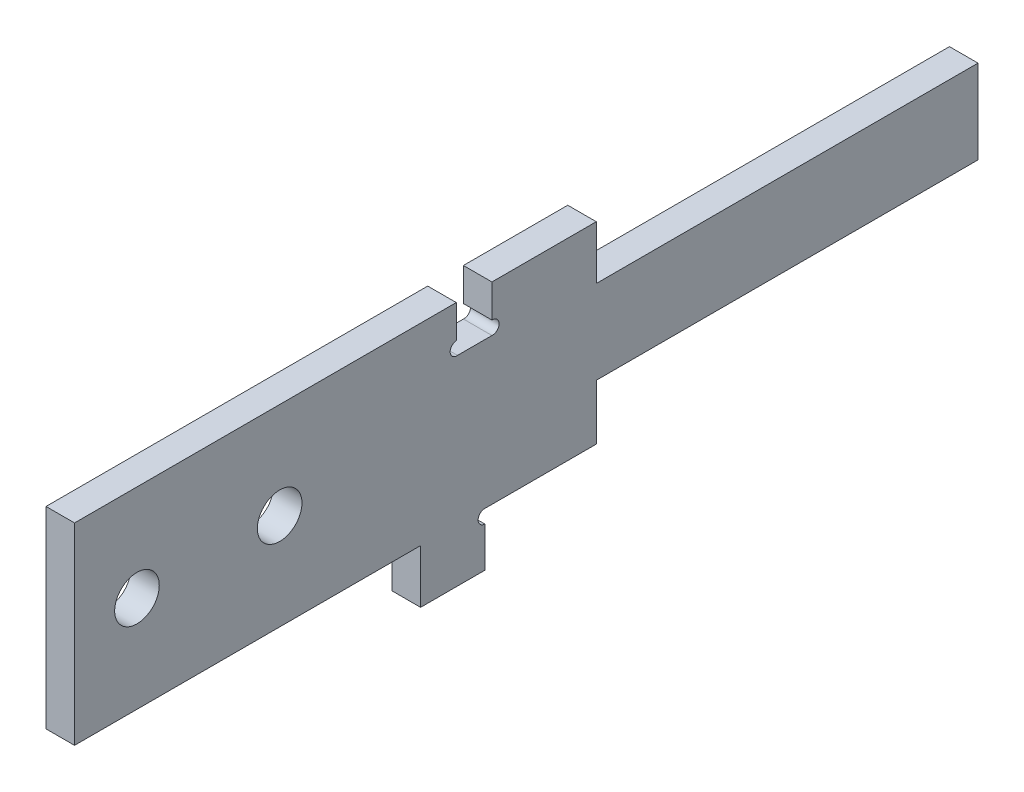
ISO-10303-21;
HEADER;
FILE_DESCRIPTION(('STEP AP214'),'2;1');
FILE_NAME('part.step','',(''),(''),'','','');
FILE_SCHEMA(('AUTOMOTIVE_DESIGN { 1 0 10303 214 1 1 1 1 }'));
ENDSEC;
DATA;
#1=APPLICATION_CONTEXT('core data for automotive mechanical design processes');
#2=APPLICATION_PROTOCOL_DEFINITION('international standard','automotive_design',2000,#1);
#3=PRODUCT_CONTEXT('',#1,'mechanical');
#4=PRODUCT('Part','Part','',(#3));
#5=PRODUCT_RELATED_PRODUCT_CATEGORY('part','',(#4));
#6=PRODUCT_DEFINITION_FORMATION('','',#4);
#7=PRODUCT_DEFINITION_CONTEXT('part definition',#1,'design');
#8=PRODUCT_DEFINITION('design','',#6,#7);
#9=PRODUCT_DEFINITION_SHAPE('','',#8);
#10=(LENGTH_UNIT() NAMED_UNIT(*) SI_UNIT(.MILLI.,.METRE.));
#11=(NAMED_UNIT(*) PLANE_ANGLE_UNIT() SI_UNIT($,.RADIAN.));
#12=(NAMED_UNIT(*) SI_UNIT($,.STERADIAN.) SOLID_ANGLE_UNIT());
#13=UNCERTAINTY_MEASURE_WITH_UNIT(LENGTH_MEASURE(1.E-05),#10,'distance_accuracy_value','');
#14=(GEOMETRIC_REPRESENTATION_CONTEXT(3) GLOBAL_UNCERTAINTY_ASSIGNED_CONTEXT((#13)) GLOBAL_UNIT_ASSIGNED_CONTEXT((#10,
#11,#12)) REPRESENTATION_CONTEXT('',''));
#15=CARTESIAN_POINT('',(0.,0.,0.));
#16=DIRECTION('',(0.,0.,1.));
#17=DIRECTION('',(1.,0.,0.));
#18=AXIS2_PLACEMENT_3D('',#15,#16,#17);
#19=CARTESIAN_POINT('',(-23.0168766341811,4.58768718801996,60.));
#20=DIRECTION('',(0.,1.,0.));
#21=DIRECTION('',(0.,0.,1.));
#22=AXIS2_PLACEMENT_3D('',#19,#20,#21);
#23=PLANE('',#22);
#24=DIRECTION('',(1.,0.,0.));
#25=VECTOR('',#24,1.);
#26=CARTESIAN_POINT('',(-23.0168766341811,4.58768718801996,37.));
#27=LINE('',#26,#25);
#28=CARTESIAN_POINT('',(-23.0168766341811,4.58768718801996,37.));
#29=VERTEX_POINT('',#28);
#30=CARTESIAN_POINT('',(-21.4168766341811,4.58768718801996,37.));
#31=VERTEX_POINT('',#30);
#32=EDGE_CURVE('E173',#29,#31,#27,.T.);
#33=ORIENTED_EDGE('',*,*,#32,.F.);
#34=DIRECTION('',(0.,0.,-1.));
#35=VECTOR('',#34,1.);
#36=CARTESIAN_POINT('',(-23.0168766341811,4.58768718801996,60.));
#37=LINE('',#36,#35);
#38=CARTESIAN_POINT('',(-23.0168766341811,4.58768718801996,30.75));
#39=VERTEX_POINT('',#38);
#40=EDGE_CURVE('E200',#29,#39,#37,.T.);
#41=ORIENTED_EDGE('',*,*,#40,.T.);
#42=DIRECTION('',(1.,0.,0.));
#43=VECTOR('',#42,1.);
#44=CARTESIAN_POINT('',(-21.4168766341811,4.58768718801996,30.75));
#45=LINE('',#44,#43);
#46=CARTESIAN_POINT('',(-21.4168766341811,4.58768718801996,30.75));
#47=VERTEX_POINT('',#46);
#48=EDGE_CURVE('E195',#39,#47,#45,.T.);
#49=ORIENTED_EDGE('',*,*,#48,.T.);
#50=DIRECTION('',(0.,0.,-1.));
#51=VECTOR('',#50,1.);
#52=CARTESIAN_POINT('',(-21.4168766341811,4.58768718801996,60.));
#53=LINE('',#52,#51);
#54=EDGE_CURVE('E188',#31,#47,#53,.T.);
#55=ORIENTED_EDGE('',*,*,#54,.F.);
#56=EDGE_LOOP('',(#33,#41,#49,#55));
#57=FACE_BOUND('',#56,.T.);
#58=ADVANCED_FACE('F34',(#57),#23,.F.);
#59=CARTESIAN_POINT('',(-23.0168766341811,15.38768718802,60.));
#60=DIRECTION('',(1.,0.,0.));
#61=DIRECTION('',(0.,0.,-1.));
#62=AXIS2_PLACEMENT_3D('',#59,#60,#61);
#63=PLANE('',#62);
#64=ORIENTED_EDGE('',*,*,#40,.F.);
#65=CARTESIAN_POINT('',(-23.0168766341811,4.21268718801996,37.));
#66=DIRECTION('',(-1.,0.,0.));
#67=DIRECTION('',(0.,0.,1.));
#68=AXIS2_PLACEMENT_3D('',#65,#66,#67);
#69=CIRCLE('',#68,0.374999999999999);
#70=CARTESIAN_POINT('',(-23.0168766341811,3.83768718801996,37.));
#71=VERTEX_POINT('',#70);
#72=EDGE_CURVE('E176',#71,#29,#69,.T.);
#73=ORIENTED_EDGE('',*,*,#72,.F.);
#74=DIRECTION('',(0.,1.,0.));
#75=VECTOR('',#74,1.);
#76=CARTESIAN_POINT('',(-23.0168766341811,-0.675054511777042,37.));
#77=LINE('',#76,#75);
#78=CARTESIAN_POINT('',(-23.0168766341811,1.58768718801991,37.));
#79=VERTEX_POINT('',#78);
#80=EDGE_CURVE('E181',#79,#71,#77,.T.);
#81=ORIENTED_EDGE('',*,*,#80,.F.);
#82=DIRECTION('',(0.,0.,-1.));
#83=VECTOR('',#82,1.);
#84=CARTESIAN_POINT('',(-23.0168766341811,1.5876871880199,40.6));
#85=LINE('',#84,#83);
#86=CARTESIAN_POINT('',(-23.0168766341811,1.5876871880199,40.6));
#87=VERTEX_POINT('',#86);
#88=EDGE_CURVE('E303',#87,#79,#85,.T.);
#89=ORIENTED_EDGE('',*,*,#88,.F.);
#90=DIRECTION('',(0.,1.,0.));
#91=VECTOR('',#90,1.);
#92=CARTESIAN_POINT('',(-23.0168766341811,1.5876871880199,40.6));
#93=LINE('',#92,#91);
#94=CARTESIAN_POINT('',(-23.0168766341811,4.58768718801996,40.6));
#95=VERTEX_POINT('',#94);
#96=EDGE_CURVE('E315',#87,#95,#93,.T.);
#97=ORIENTED_EDGE('',*,*,#96,.T.);
#98=CARTESIAN_POINT('',(-23.0168766341811,4.58768718801996,60.));
#99=VERTEX_POINT('',#98);
#100=EDGE_CURVE('E206',#99,#95,#37,.T.);
#101=ORIENTED_EDGE('',*,*,#100,.F.);
#102=DIRECTION('',(0.,-1.,0.));
#103=VECTOR('',#102,1.);
#104=CARTESIAN_POINT('',(-23.0168766341811,15.38768718802,60.));
#105=LINE('',#104,#103);
#106=CARTESIAN_POINT('',(-23.0168766341811,15.38768718802,60.));
#107=VERTEX_POINT('',#106);
#108=EDGE_CURVE('E268',#107,#99,#105,.T.);
#109=ORIENTED_EDGE('',*,*,#108,.F.);
#110=DIRECTION('',(0.,0.,-1.));
#111=VECTOR('',#110,1.);
#112=CARTESIAN_POINT('',(-23.0168766341811,15.38768718802,60.));
#113=LINE('',#112,#111);
#114=CARTESIAN_POINT('',(-23.0168766341811,15.38768718802,38.6));
#115=VERTEX_POINT('',#114);
#116=EDGE_CURVE('E277',#107,#115,#113,.T.);
#117=ORIENTED_EDGE('',*,*,#116,.T.);
#118=DIRECTION('',(0.,1.,0.));
#119=VECTOR('',#118,1.);
#120=CARTESIAN_POINT('',(-23.0168766341811,12.78768718802,38.6));
#121=LINE('',#120,#119);
#122=CARTESIAN_POINT('',(-23.0168766341811,13.53768718802,38.6));
#123=VERTEX_POINT('',#122);
#124=EDGE_CURVE('E351',#123,#115,#121,.T.);
#125=ORIENTED_EDGE('',*,*,#124,.F.);
#126=CARTESIAN_POINT('',(-23.0168766341811,13.16268718802,38.5658288618558));
#127=DIRECTION('',(-1.,0.,0.));
#128=DIRECTION('',(0.,0.,1.));
#129=AXIS2_PLACEMENT_3D('',#126,#127,#128);
#130=CIRCLE('',#129,0.376553670387203);
#131=CARTESIAN_POINT('',(-23.0168766341811,12.78768718802,38.6));
#132=VERTEX_POINT('',#131);
#133=EDGE_CURVE('E341',#132,#123,#130,.T.);
#134=ORIENTED_EDGE('',*,*,#133,.F.);
#135=CARTESIAN_POINT('',(-23.0168766341811,13.16268718802,38.5658288618558));
#136=DIRECTION('',(-1.,0.,0.));
#137=DIRECTION('',(0.,-0.995873973594242,-0.0907470590025637));
#138=AXIS2_PLACEMENT_3D('',#135,#136,#137);
#139=CIRCLE('',#138,0.376553670387203);
#140=CARTESIAN_POINT('',(-23.0168766341811,12.78768718802,38.5316577237115));
#141=VERTEX_POINT('',#140);
#142=EDGE_CURVE('E332',#141,#132,#139,.T.);
#143=ORIENTED_EDGE('',*,*,#142,.F.);
#144=DIRECTION('',(0.,0.,1.));
#145=VECTOR('',#144,1.);
#146=CARTESIAN_POINT('',(-23.0168766341811,12.78768718802,38.6));
#147=LINE('',#146,#145);
#148=CARTESIAN_POINT('',(-23.0168766341811,12.78768718802,36.6));
#149=VERTEX_POINT('',#148);
#150=EDGE_CURVE('E39',#149,#141,#147,.T.);
#151=ORIENTED_EDGE('',*,*,#150,.F.);
#152=CARTESIAN_POINT('',(-23.0168766341811,13.16268718802,36.5734535048503));
#153=DIRECTION('',(-1.,0.,0.));
#154=DIRECTION('',(0.,0.,1.));
#155=AXIS2_PLACEMENT_3D('',#152,#153,#154);
#156=CIRCLE('',#155,0.375938447627711);
#157=CARTESIAN_POINT('',(-23.0168766341811,13.53768718802,36.6));
#158=VERTEX_POINT('',#157);
#159=EDGE_CURVE('E410',#158,#149,#156,.T.);
#160=ORIENTED_EDGE('',*,*,#159,.F.);
#161=DIRECTION('',(0.,1.,0.));
#162=VECTOR('',#161,1.);
#163=CARTESIAN_POINT('',(-23.0168766341811,12.78768718802,36.6));
#164=LINE('',#163,#162);
#165=CARTESIAN_POINT('',(-23.0168766341811,15.38768718802,36.6));
#166=VERTEX_POINT('',#165);
#167=EDGE_CURVE('E290',#158,#166,#164,.T.);
#168=ORIENTED_EDGE('',*,*,#167,.T.);
#169=CARTESIAN_POINT('',(-23.0168766341811,15.38768718802,30.75));
#170=VERTEX_POINT('',#169);
#171=EDGE_CURVE('E276',#166,#170,#113,.T.);
#172=ORIENTED_EDGE('',*,*,#171,.T.);
#173=DIRECTION('',(0.,-1.,0.));
#174=VECTOR('',#173,1.);
#175=CARTESIAN_POINT('',(-23.0168766341811,12.38768718802,30.75));
#176=LINE('',#175,#174);
#177=CARTESIAN_POINT('',(-23.0168766341811,12.38768718802,30.75));
#178=VERTEX_POINT('',#177);
#179=EDGE_CURVE('E287',#170,#178,#176,.T.);
#180=ORIENTED_EDGE('',*,*,#179,.T.);
#181=DIRECTION('',(0.,0.,-1.));
#182=VECTOR('',#181,1.);
#183=CARTESIAN_POINT('',(-23.0168766341811,12.38768718802,34.2385527085025));
#184=LINE('',#183,#182);
#185=CARTESIAN_POINT('',(-23.0168766341811,12.38768718802,9.35));
#186=VERTEX_POINT('',#185);
#187=EDGE_CURVE('E369',#178,#186,#184,.T.);
#188=ORIENTED_EDGE('',*,*,#187,.T.);
#189=DIRECTION('',(0.,1.,0.));
#190=VECTOR('',#189,1.);
#191=CARTESIAN_POINT('',(-23.0168766341811,12.38768718802,9.35));
#192=LINE('',#191,#190);
#193=CARTESIAN_POINT('',(-23.0168766341811,7.68768718801996,9.35));
#194=VERTEX_POINT('',#193);
#195=EDGE_CURVE('E388',#194,#186,#192,.T.);
#196=ORIENTED_EDGE('',*,*,#195,.F.);
#197=DIRECTION('',(0.,0.,-1.));
#198=VECTOR('',#197,1.);
#199=CARTESIAN_POINT('',(-23.0168766341811,7.68768718801996,34.2385527085025));
#200=LINE('',#199,#198);
#201=CARTESIAN_POINT('',(-23.0168766341811,7.68768718801996,30.75));
#202=VERTEX_POINT('',#201);
#203=EDGE_CURVE('E376',#202,#194,#200,.T.);
#204=ORIENTED_EDGE('',*,*,#203,.F.);
#205=DIRECTION('',(0.,-1.,0.));
#206=VECTOR('',#205,1.);
#207=CARTESIAN_POINT('',(-23.0168766341811,4.58768718801997,30.75));
#208=LINE('',#207,#206);
#209=EDGE_CURVE('E375',#202,#39,#208,.T.);
#210=ORIENTED_EDGE('',*,*,#209,.T.);
#211=EDGE_LOOP('',(#64,#73,#81,#89,#97,#101,#109,#117,#125,#134,#143,#151,#160,#168,#172,#180,
#188,#196,#204,#210));
#212=FACE_BOUND('',#211,.T.);
#213=CARTESIAN_POINT('',(-23.0168766341811,9.98768718801996,48.5));
#214=DIRECTION('',(1.,0.,0.));
#215=DIRECTION('',(0.,0.,-1.));
#216=AXIS2_PLACEMENT_3D('',#213,#214,#215);
#217=CIRCLE('',#216,1.25);
#218=CARTESIAN_POINT('',(-23.0168766341811,9.98768718801996,47.25));
#219=VERTEX_POINT('',#218);
#220=EDGE_CURVE('E252',#219,#219,#217,.T.);
#221=ORIENTED_EDGE('',*,*,#220,.T.);
#222=EDGE_LOOP('',(#221));
#223=FACE_BOUND('',#222,.T.);
#224=CARTESIAN_POINT('',(-23.0168766341811,9.98768718801996,56.5));
#225=DIRECTION('',(1.,0.,0.));
#226=DIRECTION('',(0.,0.,-1.));
#227=AXIS2_PLACEMENT_3D('',#224,#225,#226);
#228=CIRCLE('',#227,1.25);
#229=CARTESIAN_POINT('',(-23.0168766341811,9.98768718801996,55.25));
#230=VERTEX_POINT('',#229);
#231=EDGE_CURVE('E255',#230,#230,#228,.T.);
#232=ORIENTED_EDGE('',*,*,#231,.T.);
#233=EDGE_LOOP('',(#232));
#234=FACE_BOUND('',#233,.T.);
#235=ADVANCED_FACE('F36',(#212,#223,#234),#63,.F.);
#236=CARTESIAN_POINT('',(-21.4168766341811,15.38768718802,60.));
#237=DIRECTION('',(-1.,0.,0.));
#238=DIRECTION('',(0.,0.,1.));
#239=AXIS2_PLACEMENT_3D('',#236,#237,#238);
#240=PLANE('',#239);
#241=DIRECTION('',(0.,1.,0.));
#242=VECTOR('',#241,1.);
#243=CARTESIAN_POINT('',(-21.4168766341811,-0.675054511777042,37.));
#244=LINE('',#243,#242);
#245=CARTESIAN_POINT('',(-21.4168766341811,1.58768718801991,37.));
#246=VERTEX_POINT('',#245);
#247=CARTESIAN_POINT('',(-21.4168766341811,3.83768718801996,37.));
#248=VERTEX_POINT('',#247);
#249=EDGE_CURVE('E180',#246,#248,#244,.T.);
#250=ORIENTED_EDGE('',*,*,#249,.T.);
#251=CARTESIAN_POINT('',(-21.4168766341811,4.21268718801996,37.));
#252=DIRECTION('',(-1.,0.,0.));
#253=DIRECTION('',(0.,0.,1.));
#254=AXIS2_PLACEMENT_3D('',#251,#252,#253);
#255=CIRCLE('',#254,0.374999999999999);
#256=EDGE_CURVE('E61',#31,#248,#255,.F.);
#257=ORIENTED_EDGE('',*,*,#256,.F.);
#258=ORIENTED_EDGE('',*,*,#54,.T.);
#259=DIRECTION('',(0.,1.,0.));
#260=VECTOR('',#259,1.);
#261=CARTESIAN_POINT('',(-21.4168766341811,4.58768718801996,30.75));
#262=LINE('',#261,#260);
#263=CARTESIAN_POINT('',(-21.4168766341811,7.68768718801996,30.75));
#264=VERTEX_POINT('',#263);
#265=EDGE_CURVE('E383',#47,#264,#262,.T.);
#266=ORIENTED_EDGE('',*,*,#265,.T.);
#267=DIRECTION('',(0.,0.,-1.));
#268=VECTOR('',#267,1.);
#269=CARTESIAN_POINT('',(-21.4168766341811,7.68768718801996,34.2385527085025));
#270=LINE('',#269,#268);
#271=CARTESIAN_POINT('',(-21.4168766341811,7.68768718801996,9.35));
#272=VERTEX_POINT('',#271);
#273=EDGE_CURVE('E379',#264,#272,#270,.T.);
#274=ORIENTED_EDGE('',*,*,#273,.T.);
#275=DIRECTION('',(0.,-1.,0.));
#276=VECTOR('',#275,1.);
#277=CARTESIAN_POINT('',(-21.4168766341811,12.38768718802,9.35));
#278=LINE('',#277,#276);
#279=CARTESIAN_POINT('',(-21.4168766341811,12.38768718802,9.35));
#280=VERTEX_POINT('',#279);
#281=EDGE_CURVE('E392',#280,#272,#278,.T.);
#282=ORIENTED_EDGE('',*,*,#281,.F.);
#283=DIRECTION('',(0.,0.,-1.));
#284=VECTOR('',#283,1.);
#285=CARTESIAN_POINT('',(-21.4168766341811,12.38768718802,34.2385527085025));
#286=LINE('',#285,#284);
#287=CARTESIAN_POINT('',(-21.4168766341811,12.38768718802,30.75));
#288=VERTEX_POINT('',#287);
#289=EDGE_CURVE('E309',#288,#280,#286,.T.);
#290=ORIENTED_EDGE('',*,*,#289,.F.);
#291=DIRECTION('',(0.,1.,0.));
#292=VECTOR('',#291,1.);
#293=CARTESIAN_POINT('',(-21.4168766341811,12.38768718802,30.75));
#294=LINE('',#293,#292);
#295=CARTESIAN_POINT('',(-21.4168766341811,15.38768718802,30.75));
#296=VERTEX_POINT('',#295);
#297=EDGE_CURVE('E366',#288,#296,#294,.T.);
#298=ORIENTED_EDGE('',*,*,#297,.T.);
#299=DIRECTION('',(0.,0.,-1.));
#300=VECTOR('',#299,1.);
#301=CARTESIAN_POINT('',(-21.4168766341811,15.38768718802,60.));
#302=LINE('',#301,#300);
#303=CARTESIAN_POINT('',(-21.4168766341811,15.38768718802,36.6));
#304=VERTEX_POINT('',#303);
#305=EDGE_CURVE('E202',#304,#296,#302,.T.);
#306=ORIENTED_EDGE('',*,*,#305,.F.);
#307=DIRECTION('',(0.,1.,0.));
#308=VECTOR('',#307,1.);
#309=CARTESIAN_POINT('',(-21.4168766341811,12.78768718802,36.6));
#310=LINE('',#309,#308);
#311=CARTESIAN_POINT('',(-21.4168766341811,13.53768718802,36.6));
#312=VERTEX_POINT('',#311);
#313=EDGE_CURVE('E347',#312,#304,#310,.T.);
#314=ORIENTED_EDGE('',*,*,#313,.F.);
#315=CARTESIAN_POINT('',(-21.4168766341811,13.16268718802,36.5734535048503));
#316=DIRECTION('',(-1.,0.,0.));
#317=DIRECTION('',(0.,0.,1.));
#318=AXIS2_PLACEMENT_3D('',#315,#316,#317);
#319=CIRCLE('',#318,0.375938447627711);
#320=CARTESIAN_POINT('',(-21.4168766341811,12.78768718802,36.6));
#321=VERTEX_POINT('',#320);
#322=EDGE_CURVE('E364',#321,#312,#319,.F.);
#323=ORIENTED_EDGE('',*,*,#322,.F.);
#324=DIRECTION('',(0.,0.,-1.));
#325=VECTOR('',#324,1.);
#326=CARTESIAN_POINT('',(-21.4168766341811,12.78768718802,38.6));
#327=LINE('',#326,#325);
#328=CARTESIAN_POINT('',(-21.4168766341811,12.78768718802,38.5316577237115));
#329=VERTEX_POINT('',#328);
#330=EDGE_CURVE('E325',#329,#321,#327,.T.);
#331=ORIENTED_EDGE('',*,*,#330,.F.);
#332=CARTESIAN_POINT('',(-21.4168766341811,12.78768718802,38.5316577237115));
#333=CARTESIAN_POINT('',(-21.4168766341811,12.7845734102011,38.5658288618558));
#334=CARTESIAN_POINT('',(-21.4168766341811,12.78768718802,38.6));
#335=B_SPLINE_CURVE_WITH_KNOTS('',2,(#332,#333,#334),.UNSPECIFIED.,.F.,.F.,(3,3),(0.,1.),.UNSPECIFIED.);
#336=CARTESIAN_POINT('',(-21.4168766341811,12.78768718802,38.6));
#337=VERTEX_POINT('',#336);
#338=EDGE_CURVE('E52',#329,#337,#335,.T.);
#339=ORIENTED_EDGE('',*,*,#338,.T.);
#340=CARTESIAN_POINT('',(-21.4168766341811,13.16268718802,38.5658288618558));
#341=DIRECTION('',(-1.,0.,0.));
#342=DIRECTION('',(0.,0.,1.));
#343=AXIS2_PLACEMENT_3D('',#340,#341,#342);
#344=CIRCLE('',#343,0.376553670387203);
#345=CARTESIAN_POINT('',(-21.4168766341811,13.53768718802,38.6));
#346=VERTEX_POINT('',#345);
#347=EDGE_CURVE('E343',#346,#337,#344,.F.);
#348=ORIENTED_EDGE('',*,*,#347,.F.);
#349=DIRECTION('',(0.,1.,0.));
#350=VECTOR('',#349,1.);
#351=CARTESIAN_POINT('',(-21.4168766341811,12.78768718802,38.6));
#352=LINE('',#351,#350);
#353=CARTESIAN_POINT('',(-21.4168766341811,15.38768718802,38.6));
#354=VERTEX_POINT('',#353);
#355=EDGE_CURVE('E263',#346,#354,#352,.T.);
#356=ORIENTED_EDGE('',*,*,#355,.T.);
#357=CARTESIAN_POINT('',(-21.4168766341811,15.38768718802,60.));
#358=VERTEX_POINT('',#357);
#359=EDGE_CURVE('E197',#358,#354,#302,.T.);
#360=ORIENTED_EDGE('',*,*,#359,.F.);
#361=DIRECTION('',(0.,1.,0.));
#362=VECTOR('',#361,1.);
#363=CARTESIAN_POINT('',(-21.4168766341811,15.38768718802,60.));
#364=LINE('',#363,#362);
#365=CARTESIAN_POINT('',(-21.4168766341811,4.58768718801996,60.));
#366=VERTEX_POINT('',#365);
#367=EDGE_CURVE('E273',#366,#358,#364,.T.);
#368=ORIENTED_EDGE('',*,*,#367,.F.);
#369=CARTESIAN_POINT('',(-21.4168766341811,4.58768718801996,40.6));
#370=VERTEX_POINT('',#369);
#371=EDGE_CURVE('E196',#366,#370,#53,.T.);
#372=ORIENTED_EDGE('',*,*,#371,.T.);
#373=DIRECTION('',(0.,1.,0.));
#374=VECTOR('',#373,1.);
#375=CARTESIAN_POINT('',(-21.4168766341811,1.58768718801991,40.6));
#376=LINE('',#375,#374);
#377=CARTESIAN_POINT('',(-21.4168766341811,1.58768718801991,40.6));
#378=VERTEX_POINT('',#377);
#379=EDGE_CURVE('E319',#378,#370,#376,.T.);
#380=ORIENTED_EDGE('',*,*,#379,.F.);
#381=DIRECTION('',(0.,0.,1.));
#382=VECTOR('',#381,1.);
#383=CARTESIAN_POINT('',(-21.4168766341811,1.58768718801991,40.6));
#384=LINE('',#383,#382);
#385=EDGE_CURVE('E312',#246,#378,#384,.T.);
#386=ORIENTED_EDGE('',*,*,#385,.F.);
#387=EDGE_LOOP('',(#250,#257,#258,#266,#274,#282,#290,#298,#306,#314,#323,#331,#339,#348,#356,
#360,#368,#372,#380,#386));
#388=FACE_BOUND('',#387,.T.);
#389=CARTESIAN_POINT('',(-21.4168766341811,9.98768718801996,48.5));
#390=DIRECTION('',(1.,0.,0.));
#391=DIRECTION('',(0.,0.,-1.));
#392=AXIS2_PLACEMENT_3D('',#389,#390,#391);
#393=CIRCLE('',#392,1.25);
#394=CARTESIAN_POINT('',(-21.4168766341811,9.98768718801996,47.25));
#395=VERTEX_POINT('',#394);
#396=EDGE_CURVE('E257',#395,#395,#393,.T.);
#397=ORIENTED_EDGE('',*,*,#396,.F.);
#398=EDGE_LOOP('',(#397));
#399=FACE_BOUND('',#398,.T.);
#400=CARTESIAN_POINT('',(-21.4168766341811,9.98768718801996,56.5));
#401=DIRECTION('',(1.,0.,0.));
#402=DIRECTION('',(0.,0.,-1.));
#403=AXIS2_PLACEMENT_3D('',#400,#401,#402);
#404=CIRCLE('',#403,1.25);
#405=CARTESIAN_POINT('',(-21.4168766341811,9.98768718801996,55.25));
#406=VERTEX_POINT('',#405);
#407=EDGE_CURVE('E258',#406,#406,#404,.T.);
#408=ORIENTED_EDGE('',*,*,#407,.F.);
#409=EDGE_LOOP('',(#408));
#410=FACE_BOUND('',#409,.T.);
#411=ADVANCED_FACE('F185',(#388,#399,#410),#240,.F.);
#412=CARTESIAN_POINT('',(-21.4168766341811,12.38768718802,34.2385527085025));
#413=DIRECTION('',(0.,-1.,0.));
#414=DIRECTION('',(0.,0.,-1.));
#415=AXIS2_PLACEMENT_3D('',#412,#413,#414);
#416=PLANE('',#415);
#417=DIRECTION('',(1.,0.,0.));
#418=VECTOR('',#417,1.);
#419=CARTESIAN_POINT('',(-21.4168766341811,12.38768718802,9.35));
#420=LINE('',#419,#418);
#421=EDGE_CURVE('E380',#186,#280,#420,.T.);
#422=ORIENTED_EDGE('',*,*,#421,.F.);
#423=ORIENTED_EDGE('',*,*,#187,.F.);
#424=DIRECTION('',(1.,0.,0.));
#425=VECTOR('',#424,1.);
#426=CARTESIAN_POINT('',(-21.4168766341811,12.38768718802,30.75));
#427=LINE('',#426,#425);
#428=EDGE_CURVE('E305',#178,#288,#427,.T.);
#429=ORIENTED_EDGE('',*,*,#428,.T.);
#430=ORIENTED_EDGE('',*,*,#289,.T.);
#431=EDGE_LOOP('',(#422,#423,#429,#430));
#432=FACE_BOUND('',#431,.T.);
#433=ADVANCED_FACE('F225',(#432),#416,.F.);
#434=CARTESIAN_POINT('',(-21.4168766341811,7.68768718801996,34.2385527085025));
#435=DIRECTION('',(0.,1.,0.));
#436=DIRECTION('',(0.,0.,1.));
#437=AXIS2_PLACEMENT_3D('',#434,#435,#436);
#438=PLANE('',#437);
#439=DIRECTION('',(-1.,0.,0.));
#440=VECTOR('',#439,1.);
#441=CARTESIAN_POINT('',(-21.4168766341811,7.68768718801996,9.35));
#442=LINE('',#441,#440);
#443=EDGE_CURVE('E390',#272,#194,#442,.T.);
#444=ORIENTED_EDGE('',*,*,#443,.F.);
#445=ORIENTED_EDGE('',*,*,#273,.F.);
#446=DIRECTION('',(-1.,0.,0.));
#447=VECTOR('',#446,1.);
#448=CARTESIAN_POINT('',(-21.4168766341811,7.68768718801996,30.75));
#449=LINE('',#448,#447);
#450=EDGE_CURVE('E373',#264,#202,#449,.T.);
#451=ORIENTED_EDGE('',*,*,#450,.T.);
#452=ORIENTED_EDGE('',*,*,#203,.T.);
#453=EDGE_LOOP('',(#444,#445,#451,#452));
#454=FACE_BOUND('',#453,.T.);
#455=ADVANCED_FACE('F238',(#454),#438,.F.);
#456=CARTESIAN_POINT('',(-23.0168766341811,15.38768718802,60.));
#457=DIRECTION('',(0.,-1.,0.));
#458=DIRECTION('',(0.,0.,-1.));
#459=AXIS2_PLACEMENT_3D('',#456,#457,#458);
#460=PLANE('',#459);
#461=DIRECTION('',(-1.,0.,0.));
#462=VECTOR('',#461,1.);
#463=CARTESIAN_POINT('',(-21.4168766341811,15.38768718802,30.75));
#464=LINE('',#463,#462);
#465=EDGE_CURVE('E296',#296,#170,#464,.T.);
#466=ORIENTED_EDGE('',*,*,#465,.T.);
#467=ORIENTED_EDGE('',*,*,#171,.F.);
#468=DIRECTION('',(-1.,0.,0.));
#469=VECTOR('',#468,1.);
#470=CARTESIAN_POINT('',(-21.4168766341811,15.38768718802,36.6));
#471=LINE('',#470,#469);
#472=EDGE_CURVE('E294',#304,#166,#471,.T.);
#473=ORIENTED_EDGE('',*,*,#472,.F.);
#474=ORIENTED_EDGE('',*,*,#305,.T.);
#475=EDGE_LOOP('',(#466,#467,#473,#474));
#476=FACE_BOUND('',#475,.T.);
#477=ADVANCED_FACE('F226',(#476),#460,.F.);
#478=DIRECTION('',(-1.,0.,0.));
#479=VECTOR('',#478,1.);
#480=CARTESIAN_POINT('',(-23.0168766341811,4.5876871880199,40.6));
#481=LINE('',#480,#479);
#482=EDGE_CURVE('E300',#370,#95,#481,.T.);
#483=ORIENTED_EDGE('',*,*,#482,.F.);
#484=ORIENTED_EDGE('',*,*,#371,.F.);
#485=DIRECTION('',(1.,0.,0.));
#486=VECTOR('',#485,1.);
#487=CARTESIAN_POINT('',(-23.0168766341811,4.58768718801996,60.));
#488=LINE('',#487,#486);
#489=EDGE_CURVE('E271',#99,#366,#488,.T.);
#490=ORIENTED_EDGE('',*,*,#489,.F.);
#491=ORIENTED_EDGE('',*,*,#100,.T.);
#492=EDGE_LOOP('',(#483,#484,#490,#491));
#493=FACE_BOUND('',#492,.T.);
#494=ADVANCED_FACE('F228',(#493),#23,.F.);
#495=ORIENTED_EDGE('',*,*,#359,.T.);
#496=DIRECTION('',(1.,0.,0.));
#497=VECTOR('',#496,1.);
#498=CARTESIAN_POINT('',(-21.4168766341811,15.38768718802,38.6));
#499=LINE('',#498,#497);
#500=EDGE_CURVE('E328',#115,#354,#499,.T.);
#501=ORIENTED_EDGE('',*,*,#500,.F.);
#502=ORIENTED_EDGE('',*,*,#116,.F.);
#503=DIRECTION('',(-1.,0.,0.));
#504=VECTOR('',#503,1.);
#505=CARTESIAN_POINT('',(-23.0168766341811,15.38768718802,60.));
#506=LINE('',#505,#504);
#507=EDGE_CURVE('E275',#358,#107,#506,.T.);
#508=ORIENTED_EDGE('',*,*,#507,.F.);
#509=EDGE_LOOP('',(#495,#501,#502,#508));
#510=FACE_BOUND('',#509,.T.);
#511=ADVANCED_FACE('F230',(#510),#460,.F.);
#512=CARTESIAN_POINT('',(0.,0.,60.));
#513=DIRECTION('',(0.,0.,1.));
#514=DIRECTION('',(1.,0.,0.));
#515=AXIS2_PLACEMENT_3D('',#512,#513,#514);
#516=PLANE('',#515);
#517=ORIENTED_EDGE('',*,*,#108,.T.);
#518=ORIENTED_EDGE('',*,*,#489,.T.);
#519=ORIENTED_EDGE('',*,*,#367,.T.);
#520=ORIENTED_EDGE('',*,*,#507,.T.);
#521=EDGE_LOOP('',(#517,#518,#519,#520));
#522=FACE_BOUND('',#521,.T.);
#523=ADVANCED_FACE('F236',(#522),#516,.T.);
#524=CARTESIAN_POINT('',(-81.4168766341811,9.98768718801996,48.5));
#525=DIRECTION('',(1.,0.,0.));
#526=DIRECTION('',(0.,0.,-1.));
#527=AXIS2_PLACEMENT_3D('',#524,#525,#526);
#528=CYLINDRICAL_SURFACE('',#527,1.25);
#529=ORIENTED_EDGE('',*,*,#396,.T.);
#530=EDGE_LOOP('',(#529));
#531=FACE_BOUND('',#530,.T.);
#532=ORIENTED_EDGE('',*,*,#220,.F.);
#533=EDGE_LOOP('',(#532));
#534=FACE_BOUND('',#533,.T.);
#535=ADVANCED_FACE('F470',(#531,#534),#528,.F.);
#536=CARTESIAN_POINT('',(-81.4168766341811,9.98768718801996,56.5));
#537=DIRECTION('',(1.,0.,0.));
#538=DIRECTION('',(0.,0.,-1.));
#539=AXIS2_PLACEMENT_3D('',#536,#537,#538);
#540=CYLINDRICAL_SURFACE('',#539,1.25);
#541=ORIENTED_EDGE('',*,*,#407,.T.);
#542=EDGE_LOOP('',(#541));
#543=FACE_BOUND('',#542,.T.);
#544=ORIENTED_EDGE('',*,*,#231,.F.);
#545=EDGE_LOOP('',(#544));
#546=FACE_BOUND('',#545,.T.);
#547=ADVANCED_FACE('F464',(#543,#546),#540,.F.);
#548=CARTESIAN_POINT('',(-21.4168766341811,12.78768718802,38.6));
#549=DIRECTION('',(0.,0.,1.));
#550=DIRECTION('',(1.,0.,0.));
#551=AXIS2_PLACEMENT_3D('',#548,#549,#550);
#552=PLANE('',#551);
#553=ORIENTED_EDGE('',*,*,#355,.F.);
#554=DIRECTION('',(-1.,0.,0.));
#555=VECTOR('',#554,1.);
#556=CARTESIAN_POINT('',(-20.3518220189352,13.53768718802,38.6));
#557=LINE('',#556,#555);
#558=EDGE_CURVE('E361',#346,#123,#557,.T.);
#559=ORIENTED_EDGE('',*,*,#558,.T.);
#560=ORIENTED_EDGE('',*,*,#124,.T.);
#561=ORIENTED_EDGE('',*,*,#500,.T.);
#562=EDGE_LOOP('',(#553,#559,#560,#561));
#563=FACE_BOUND('',#562,.T.);
#564=ADVANCED_FACE('F461',(#563),#552,.F.);
#565=CARTESIAN_POINT('',(-21.4168766341811,12.78768718802,36.6));
#566=DIRECTION('',(0.,0.,-1.));
#567=DIRECTION('',(-1.,0.,0.));
#568=AXIS2_PLACEMENT_3D('',#565,#566,#567);
#569=PLANE('',#568);
#570=ORIENTED_EDGE('',*,*,#167,.F.);
#571=DIRECTION('',(-1.,0.,0.));
#572=VECTOR('',#571,1.);
#573=CARTESIAN_POINT('',(-20.3518220189352,13.53768718802,36.6));
#574=LINE('',#573,#572);
#575=EDGE_CURVE('E191',#158,#312,#574,.F.);
#576=ORIENTED_EDGE('',*,*,#575,.T.);
#577=ORIENTED_EDGE('',*,*,#313,.T.);
#578=ORIENTED_EDGE('',*,*,#472,.T.);
#579=EDGE_LOOP('',(#570,#576,#577,#578));
#580=FACE_BOUND('',#579,.T.);
#581=ADVANCED_FACE('F359',(#580),#569,.F.);
#582=CARTESIAN_POINT('',(0.,12.78768718802,0.));
#583=DIRECTION('',(0.,1.,0.));
#584=DIRECTION('',(0.,0.,1.));
#585=AXIS2_PLACEMENT_3D('',#582,#583,#584);
#586=PLANE('',#585);
#587=DIRECTION('',(-1.,0.,0.));
#588=VECTOR('',#587,1.);
#589=CARTESIAN_POINT('',(-20.3518220189352,12.78768718802,38.5316577237115));
#590=LINE('',#589,#588);
#591=EDGE_CURVE('E11',#329,#141,#590,.T.);
#592=ORIENTED_EDGE('',*,*,#591,.F.);
#593=ORIENTED_EDGE('',*,*,#330,.T.);
#594=DIRECTION('',(-1.,0.,0.));
#595=VECTOR('',#594,1.);
#596=CARTESIAN_POINT('',(-21.4168766341811,12.78768718802,36.6));
#597=LINE('',#596,#595);
#598=EDGE_CURVE('E324',#321,#149,#597,.T.);
#599=ORIENTED_EDGE('',*,*,#598,.T.);
#600=ORIENTED_EDGE('',*,*,#150,.T.);
#601=EDGE_LOOP('',(#592,#593,#599,#600));
#602=FACE_BOUND('',#601,.T.);
#603=ADVANCED_FACE('F346',(#602),#586,.T.);
#604=CARTESIAN_POINT('',(-23.0168766341811,1.5876871880199,40.6));
#605=DIRECTION('',(0.,0.,-1.));
#606=DIRECTION('',(-1.,0.,0.));
#607=AXIS2_PLACEMENT_3D('',#604,#605,#606);
#608=PLANE('',#607);
#609=ORIENTED_EDGE('',*,*,#482,.T.);
#610=ORIENTED_EDGE('',*,*,#96,.F.);
#611=DIRECTION('',(-1.,0.,0.));
#612=VECTOR('',#611,1.);
#613=CARTESIAN_POINT('',(-23.0168766341811,1.5876871880199,40.6));
#614=LINE('',#613,#612);
#615=EDGE_CURVE('E314',#378,#87,#614,.T.);
#616=ORIENTED_EDGE('',*,*,#615,.F.);
#617=ORIENTED_EDGE('',*,*,#379,.T.);
#618=EDGE_LOOP('',(#609,#610,#616,#617));
#619=FACE_BOUND('',#618,.T.);
#620=ADVANCED_FACE('F454',(#619),#608,.F.);
#621=CARTESIAN_POINT('',(0.,1.58768718801995,0.));
#622=DIRECTION('',(0.,-1.,0.));
#623=DIRECTION('',(1.,0.,0.));
#624=AXIS2_PLACEMENT_3D('',#621,#622,#623);
#625=PLANE('',#624);
#626=ORIENTED_EDGE('',*,*,#88,.T.);
#627=DIRECTION('',(1.,0.,0.));
#628=VECTOR('',#627,1.);
#629=CARTESIAN_POINT('',(-23.0168766341811,1.5876871880199,37.));
#630=LINE('',#629,#628);
#631=EDGE_CURVE('E394',#79,#246,#630,.T.);
#632=ORIENTED_EDGE('',*,*,#631,.T.);
#633=ORIENTED_EDGE('',*,*,#385,.T.);
#634=ORIENTED_EDGE('',*,*,#615,.T.);
#635=EDGE_LOOP('',(#626,#632,#633,#634));
#636=FACE_BOUND('',#635,.T.);
#637=ADVANCED_FACE('F448',(#636),#625,.T.);
#638=CARTESIAN_POINT('',(-30.7168766341811,24.62143718802,30.75));
#639=DIRECTION('',(0.,0.,-1.));
#640=DIRECTION('',(1.,0.,0.));
#641=AXIS2_PLACEMENT_3D('',#638,#639,#640);
#642=PLANE('',#641);
#643=ORIENTED_EDGE('',*,*,#179,.F.);
#644=ORIENTED_EDGE('',*,*,#465,.F.);
#645=ORIENTED_EDGE('',*,*,#297,.F.);
#646=ORIENTED_EDGE('',*,*,#428,.F.);
#647=EDGE_LOOP('',(#643,#644,#645,#646));
#648=FACE_BOUND('',#647,.T.);
#649=ADVANCED_FACE('F441',(#648),#642,.T.);
#650=CARTESIAN_POINT('',(-30.7168766341811,24.62143718802,30.75));
#651=DIRECTION('',(0.,0.,-1.));
#652=DIRECTION('',(1.,0.,0.));
#653=AXIS2_PLACEMENT_3D('',#650,#651,#652);
#654=PLANE('',#653);
#655=ORIENTED_EDGE('',*,*,#209,.F.);
#656=ORIENTED_EDGE('',*,*,#450,.F.);
#657=ORIENTED_EDGE('',*,*,#265,.F.);
#658=ORIENTED_EDGE('',*,*,#48,.F.);
#659=EDGE_LOOP('',(#655,#656,#657,#658));
#660=FACE_BOUND('',#659,.T.);
#661=ADVANCED_FACE('F437',(#660),#654,.T.);
#662=CARTESIAN_POINT('',(0.,0.,9.35));
#663=DIRECTION('',(0.,0.,-1.));
#664=DIRECTION('',(-1.,0.,0.));
#665=AXIS2_PLACEMENT_3D('',#662,#663,#664);
#666=PLANE('',#665);
#667=ORIENTED_EDGE('',*,*,#281,.T.);
#668=ORIENTED_EDGE('',*,*,#443,.T.);
#669=ORIENTED_EDGE('',*,*,#195,.T.);
#670=ORIENTED_EDGE('',*,*,#421,.T.);
#671=EDGE_LOOP('',(#667,#668,#669,#670));
#672=FACE_BOUND('',#671,.T.);
#673=ADVANCED_FACE('F433',(#672),#666,.T.);
#674=CARTESIAN_POINT('',(-23.0168766341811,-0.675054511777042,37.));
#675=DIRECTION('',(0.,0.,1.));
#676=DIRECTION('',(1.,0.,0.));
#677=AXIS2_PLACEMENT_3D('',#674,#675,#676);
#678=PLANE('',#677);
#679=ORIENTED_EDGE('',*,*,#80,.T.);
#680=DIRECTION('',(-1.,0.,0.));
#681=VECTOR('',#680,1.);
#682=CARTESIAN_POINT('',(-20.3518220189352,3.83768718801996,37.));
#683=LINE('',#682,#681);
#684=EDGE_CURVE('E45',#71,#248,#683,.F.);
#685=ORIENTED_EDGE('',*,*,#684,.T.);
#686=ORIENTED_EDGE('',*,*,#249,.F.);
#687=ORIENTED_EDGE('',*,*,#631,.F.);
#688=EDGE_LOOP('',(#679,#685,#686,#687));
#689=FACE_BOUND('',#688,.T.);
#690=ADVANCED_FACE('F430',(#689),#678,.F.);
#691=CARTESIAN_POINT('',(-20.3518220189352,4.21268718801996,37.));
#692=DIRECTION('',(-1.,0.,0.));
#693=DIRECTION('',(0.,0.,1.));
#694=AXIS2_PLACEMENT_3D('',#691,#692,#693);
#695=CYLINDRICAL_SURFACE('',#694,0.374999999999999);
#696=ORIENTED_EDGE('',*,*,#256,.T.);
#697=ORIENTED_EDGE('',*,*,#684,.F.);
#698=ORIENTED_EDGE('',*,*,#72,.T.);
#699=ORIENTED_EDGE('',*,*,#32,.T.);
#700=EDGE_LOOP('',(#696,#697,#698,#699));
#701=FACE_BOUND('',#700,.T.);
#702=ADVANCED_FACE('F174',(#701),#695,.F.);
#703=CARTESIAN_POINT('',(-20.3518220189352,13.16268718802,36.5734535048503));
#704=DIRECTION('',(-1.,0.,0.));
#705=DIRECTION('',(0.,0.,1.));
#706=AXIS2_PLACEMENT_3D('',#703,#704,#705);
#707=CYLINDRICAL_SURFACE('',#706,0.375938447627711);
#708=ORIENTED_EDGE('',*,*,#159,.T.);
#709=ORIENTED_EDGE('',*,*,#598,.F.);
#710=ORIENTED_EDGE('',*,*,#322,.T.);
#711=ORIENTED_EDGE('',*,*,#575,.F.);
#712=EDGE_LOOP('',(#708,#709,#710,#711));
#713=FACE_BOUND('',#712,.T.);
#714=ADVANCED_FACE('F426',(#713),#707,.F.);
#715=CARTESIAN_POINT('',(-20.3518220189352,13.16268718802,38.5658288618558));
#716=DIRECTION('',(-1.,0.,0.));
#717=DIRECTION('',(0.,0.,1.));
#718=AXIS2_PLACEMENT_3D('',#715,#716,#717);
#719=CYLINDRICAL_SURFACE('',#718,0.376553670387203);
#720=ORIENTED_EDGE('',*,*,#347,.T.);
#721=ORIENTED_EDGE('',*,*,#338,.F.);
#722=ORIENTED_EDGE('',*,*,#591,.T.);
#723=ORIENTED_EDGE('',*,*,#142,.T.);
#724=ORIENTED_EDGE('',*,*,#133,.T.);
#725=ORIENTED_EDGE('',*,*,#558,.F.);
#726=EDGE_LOOP('',(#720,#721,#722,#723,#724,#725));
#727=FACE_BOUND('',#726,.T.);
#728=ADVANCED_FACE('F416',(#727),#719,.F.);
#729=CLOSED_SHELL('',(#58,#235,#411,#433,#455,#477,#494,#511,#523,#535,#547,#564,#581,#603,#620,
#637,#649,#661,#673,#690,#702,#714,#728));
#730=MANIFOLD_SOLID_BREP('B2',#729);
#731=ADVANCED_BREP_SHAPE_REPRESENTATION('',(#18,#730),#14);
#732=SHAPE_DEFINITION_REPRESENTATION(#9,#731);
ENDSEC;
END-ISO-10303-21;
